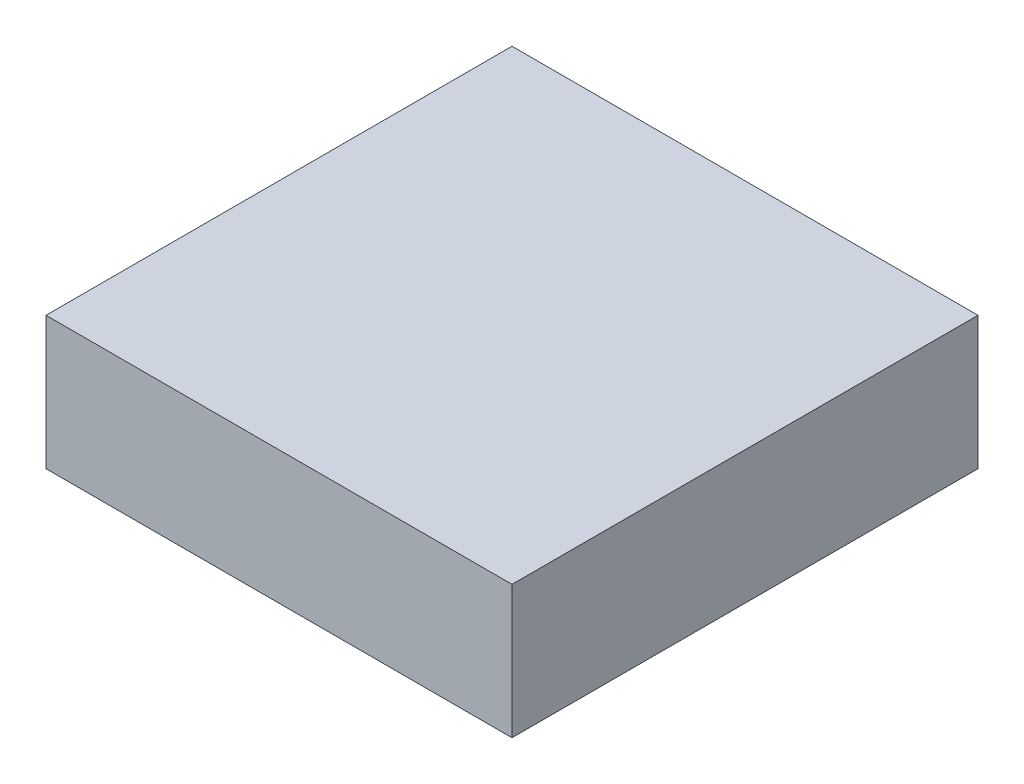
ISO-10303-21;
HEADER;
FILE_DESCRIPTION(('STEP AP214'),'2;1');
FILE_NAME('part.step','',(''),(''),'','','');
FILE_SCHEMA(('AUTOMOTIVE_DESIGN { 1 0 10303 214 1 1 1 1 }'));
ENDSEC;
DATA;
#1=APPLICATION_CONTEXT('core data for automotive mechanical design processes');
#2=APPLICATION_PROTOCOL_DEFINITION('international standard','automotive_design',2000,#1);
#3=PRODUCT_CONTEXT('',#1,'mechanical');
#4=PRODUCT('Part','Part','',(#3));
#5=PRODUCT_RELATED_PRODUCT_CATEGORY('part','',(#4));
#6=PRODUCT_DEFINITION_FORMATION('','',#4);
#7=PRODUCT_DEFINITION_CONTEXT('part definition',#1,'design');
#8=PRODUCT_DEFINITION('design','',#6,#7);
#9=PRODUCT_DEFINITION_SHAPE('','',#8);
#10=(LENGTH_UNIT() NAMED_UNIT(*) SI_UNIT(.MILLI.,.METRE.));
#11=(NAMED_UNIT(*) PLANE_ANGLE_UNIT() SI_UNIT($,.RADIAN.));
#12=(NAMED_UNIT(*) SI_UNIT($,.STERADIAN.) SOLID_ANGLE_UNIT());
#13=UNCERTAINTY_MEASURE_WITH_UNIT(LENGTH_MEASURE(1.E-05),#10,'distance_accuracy_value','');
#14=(GEOMETRIC_REPRESENTATION_CONTEXT(3) GLOBAL_UNCERTAINTY_ASSIGNED_CONTEXT((#13)) GLOBAL_UNIT_ASSIGNED_CONTEXT((#10,
#11,#12)) REPRESENTATION_CONTEXT('',''));
#15=CARTESIAN_POINT('',(0.,0.,0.));
#16=DIRECTION('',(0.,0.,1.));
#17=DIRECTION('',(1.,0.,0.));
#18=AXIS2_PLACEMENT_3D('',#15,#16,#17);
#19=CARTESIAN_POINT('',(-49.1,-28.,-49.1));
#20=DIRECTION('',(-1.,0.,0.));
#21=DIRECTION('',(0.,0.,1.));
#22=AXIS2_PLACEMENT_3D('',#19,#20,#21);
#23=PLANE('',#22);
#24=DIRECTION('',(0.,0.,1.));
#25=VECTOR('',#24,1.);
#26=CARTESIAN_POINT('',(-49.1,0.,-49.1));
#27=LINE('',#26,#25);
#28=CARTESIAN_POINT('',(-49.1,0.,-49.1));
#29=VERTEX_POINT('',#28);
#30=CARTESIAN_POINT('',(-49.1,0.,49.1));
#31=VERTEX_POINT('',#30);
#32=EDGE_CURVE('E282',#29,#31,#27,.T.);
#33=ORIENTED_EDGE('',*,*,#32,.F.);
#34=DIRECTION('',(0.,1.,0.));
#35=VECTOR('',#34,1.);
#36=CARTESIAN_POINT('',(-49.1,-28.,-49.1));
#37=LINE('',#36,#35);
#38=CARTESIAN_POINT('',(-49.1,-28.,-49.1));
#39=VERTEX_POINT('',#38);
#40=EDGE_CURVE('E11',#39,#29,#37,.T.);
#41=ORIENTED_EDGE('',*,*,#40,.F.);
#42=DIRECTION('',(0.,0.,1.));
#43=VECTOR('',#42,1.);
#44=CARTESIAN_POINT('',(-49.1,-28.,-49.1));
#45=LINE('',#44,#43);
#46=CARTESIAN_POINT('',(-49.1,-28.,49.1));
#47=VERTEX_POINT('',#46);
#48=EDGE_CURVE('E292',#39,#47,#45,.T.);
#49=ORIENTED_EDGE('',*,*,#48,.T.);
#50=DIRECTION('',(0.,1.,0.));
#51=VECTOR('',#50,1.);
#52=CARTESIAN_POINT('',(-49.1,-28.,49.1));
#53=LINE('',#52,#51);
#54=EDGE_CURVE('E44',#47,#31,#53,.T.);
#55=ORIENTED_EDGE('',*,*,#54,.T.);
#56=EDGE_LOOP('',(#33,#41,#49,#55));
#57=FACE_BOUND('',#56,.T.);
#58=ADVANCED_FACE('F41',(#57),#23,.T.);
#59=CARTESIAN_POINT('',(-49.1,-28.,-49.1));
#60=DIRECTION('',(0.,0.,-1.));
#61=DIRECTION('',(-1.,0.,0.));
#62=AXIS2_PLACEMENT_3D('',#59,#60,#61);
#63=PLANE('',#62);
#64=DIRECTION('',(-1.,0.,0.));
#65=VECTOR('',#64,1.);
#66=CARTESIAN_POINT('',(-49.1,0.,-49.1));
#67=LINE('',#66,#65);
#68=CARTESIAN_POINT('',(49.1,0.,-49.1));
#69=VERTEX_POINT('',#68);
#70=EDGE_CURVE('E297',#69,#29,#67,.T.);
#71=ORIENTED_EDGE('',*,*,#70,.F.);
#72=DIRECTION('',(0.,1.,0.));
#73=VECTOR('',#72,1.);
#74=CARTESIAN_POINT('',(49.1,-28.,-49.1));
#75=LINE('',#74,#73);
#76=CARTESIAN_POINT('',(49.1,-28.,-49.1));
#77=VERTEX_POINT('',#76);
#78=EDGE_CURVE('E50',#77,#69,#75,.T.);
#79=ORIENTED_EDGE('',*,*,#78,.F.);
#80=DIRECTION('',(-1.,0.,0.));
#81=VECTOR('',#80,1.);
#82=CARTESIAN_POINT('',(-49.1,-28.,-49.1));
#83=LINE('',#82,#81);
#84=EDGE_CURVE('E305',#77,#39,#83,.T.);
#85=ORIENTED_EDGE('',*,*,#84,.T.);
#86=ORIENTED_EDGE('',*,*,#40,.T.);
#87=EDGE_LOOP('',(#71,#79,#85,#86));
#88=FACE_BOUND('',#87,.T.);
#89=ADVANCED_FACE('F339',(#88),#63,.T.);
#90=CARTESIAN_POINT('',(49.1,-28.,-49.1));
#91=DIRECTION('',(1.,0.,0.));
#92=DIRECTION('',(0.,0.,-1.));
#93=AXIS2_PLACEMENT_3D('',#90,#91,#92);
#94=PLANE('',#93);
#95=DIRECTION('',(0.,0.,-1.));
#96=VECTOR('',#95,1.);
#97=CARTESIAN_POINT('',(49.1,0.,-49.1));
#98=LINE('',#97,#96);
#99=CARTESIAN_POINT('',(49.1,0.,49.1));
#100=VERTEX_POINT('',#99);
#101=EDGE_CURVE('E316',#100,#69,#98,.T.);
#102=ORIENTED_EDGE('',*,*,#101,.F.);
#103=DIRECTION('',(0.,1.,0.));
#104=VECTOR('',#103,1.);
#105=CARTESIAN_POINT('',(49.1,-28.,49.1));
#106=LINE('',#105,#104);
#107=CARTESIAN_POINT('',(49.1,-28.,49.1));
#108=VERTEX_POINT('',#107);
#109=EDGE_CURVE('E324',#108,#100,#106,.T.);
#110=ORIENTED_EDGE('',*,*,#109,.F.);
#111=DIRECTION('',(0.,0.,-1.));
#112=VECTOR('',#111,1.);
#113=CARTESIAN_POINT('',(49.1,-28.,-49.1));
#114=LINE('',#113,#112);
#115=EDGE_CURVE('E301',#108,#77,#114,.T.);
#116=ORIENTED_EDGE('',*,*,#115,.T.);
#117=ORIENTED_EDGE('',*,*,#78,.T.);
#118=EDGE_LOOP('',(#102,#110,#116,#117));
#119=FACE_BOUND('',#118,.T.);
#120=ADVANCED_FACE('F345',(#119),#94,.T.);
#121=CARTESIAN_POINT('',(-49.1,-28.,49.1));
#122=DIRECTION('',(0.,0.,1.));
#123=DIRECTION('',(1.,0.,0.));
#124=AXIS2_PLACEMENT_3D('',#121,#122,#123);
#125=PLANE('',#124);
#126=DIRECTION('',(1.,0.,0.));
#127=VECTOR('',#126,1.);
#128=CARTESIAN_POINT('',(-49.1,0.,49.1));
#129=LINE('',#128,#127);
#130=EDGE_CURVE('E312',#31,#100,#129,.T.);
#131=ORIENTED_EDGE('',*,*,#130,.F.);
#132=ORIENTED_EDGE('',*,*,#54,.F.);
#133=DIRECTION('',(1.,0.,0.));
#134=VECTOR('',#133,1.);
#135=CARTESIAN_POINT('',(-49.1,-28.,49.1));
#136=LINE('',#135,#134);
#137=EDGE_CURVE('E296',#47,#108,#136,.T.);
#138=ORIENTED_EDGE('',*,*,#137,.T.);
#139=ORIENTED_EDGE('',*,*,#109,.T.);
#140=EDGE_LOOP('',(#131,#132,#138,#139));
#141=FACE_BOUND('',#140,.T.);
#142=ADVANCED_FACE('F334',(#141),#125,.T.);
#143=CARTESIAN_POINT('',(0.,-28.,0.));
#144=DIRECTION('',(0.,1.,0.));
#145=DIRECTION('',(0.,0.,1.));
#146=AXIS2_PLACEMENT_3D('',#143,#144,#145);
#147=PLANE('',#146);
#148=DIRECTION('',(1.,0.,0.));
#149=VECTOR('',#148,1.);
#150=CARTESIAN_POINT('',(-45.1,-28.,-45.1));
#151=LINE('',#150,#149);
#152=CARTESIAN_POINT('',(-45.1,-28.,-45.1));
#153=VERTEX_POINT('',#152);
#154=CARTESIAN_POINT('',(45.1,-28.,-45.1));
#155=VERTEX_POINT('',#154);
#156=EDGE_CURVE('E268',#153,#155,#151,.T.);
#157=ORIENTED_EDGE('',*,*,#156,.F.);
#158=DIRECTION('',(0.,0.,-1.));
#159=VECTOR('',#158,1.);
#160=CARTESIAN_POINT('',(-45.1,-28.,45.1));
#161=LINE('',#160,#159);
#162=CARTESIAN_POINT('',(-45.1,-28.,45.1));
#163=VERTEX_POINT('',#162);
#164=EDGE_CURVE('E247',#163,#153,#161,.T.);
#165=ORIENTED_EDGE('',*,*,#164,.F.);
#166=DIRECTION('',(-1.,0.,0.));
#167=VECTOR('',#166,1.);
#168=CARTESIAN_POINT('',(-45.1,-28.,45.1));
#169=LINE('',#168,#167);
#170=CARTESIAN_POINT('',(45.1,-28.,45.1));
#171=VERTEX_POINT('',#170);
#172=EDGE_CURVE('E253',#171,#163,#169,.T.);
#173=ORIENTED_EDGE('',*,*,#172,.F.);
#174=DIRECTION('',(0.,0.,1.));
#175=VECTOR('',#174,1.);
#176=CARTESIAN_POINT('',(45.1,-28.,45.1));
#177=LINE('',#176,#175);
#178=EDGE_CURVE('E272',#155,#171,#177,.T.);
#179=ORIENTED_EDGE('',*,*,#178,.F.);
#180=EDGE_LOOP('',(#157,#165,#173,#179));
#181=FACE_BOUND('',#180,.T.);
#182=ORIENTED_EDGE('',*,*,#48,.F.);
#183=ORIENTED_EDGE('',*,*,#84,.F.);
#184=ORIENTED_EDGE('',*,*,#115,.F.);
#185=ORIENTED_EDGE('',*,*,#137,.F.);
#186=EDGE_LOOP('',(#182,#183,#184,#185));
#187=FACE_BOUND('',#186,.T.);
#188=ADVANCED_FACE('F342',(#181,#187),#147,.F.);
#189=CARTESIAN_POINT('',(0.,0.,0.));
#190=DIRECTION('',(0.,1.,0.));
#191=DIRECTION('',(0.,0.,1.));
#192=AXIS2_PLACEMENT_3D('',#189,#190,#191);
#193=PLANE('',#192);
#194=ORIENTED_EDGE('',*,*,#32,.T.);
#195=ORIENTED_EDGE('',*,*,#130,.T.);
#196=ORIENTED_EDGE('',*,*,#101,.T.);
#197=ORIENTED_EDGE('',*,*,#70,.T.);
#198=EDGE_LOOP('',(#194,#195,#196,#197));
#199=FACE_BOUND('',#198,.T.);
#200=ADVANCED_FACE('F336',(#199),#193,.T.);
#201=CARTESIAN_POINT('',(-45.1,-4.,45.1));
#202=DIRECTION('',(-1.,0.,0.));
#203=DIRECTION('',(0.,0.,1.));
#204=AXIS2_PLACEMENT_3D('',#201,#202,#203);
#205=PLANE('',#204);
#206=ORIENTED_EDGE('',*,*,#164,.T.);
#207=DIRECTION('',(0.,-1.,0.));
#208=VECTOR('',#207,1.);
#209=CARTESIAN_POINT('',(-45.1,-4.,-45.1));
#210=LINE('',#209,#208);
#211=CARTESIAN_POINT('',(-45.1,-4.,-45.1));
#212=VERTEX_POINT('',#211);
#213=EDGE_CURVE('E265',#212,#153,#210,.T.);
#214=ORIENTED_EDGE('',*,*,#213,.F.);
#215=DIRECTION('',(0.,0.,-1.));
#216=VECTOR('',#215,1.);
#217=CARTESIAN_POINT('',(-45.1,-4.,45.1));
#218=LINE('',#217,#216);
#219=CARTESIAN_POINT('',(-45.1,-4.,45.1));
#220=VERTEX_POINT('',#219);
#221=EDGE_CURVE('E248',#220,#212,#218,.T.);
#222=ORIENTED_EDGE('',*,*,#221,.F.);
#223=DIRECTION('',(0.,-1.,0.));
#224=VECTOR('',#223,1.);
#225=CARTESIAN_POINT('',(-45.1,-4.,45.1));
#226=LINE('',#225,#224);
#227=EDGE_CURVE('E279',#220,#163,#226,.T.);
#228=ORIENTED_EDGE('',*,*,#227,.T.);
#229=EDGE_LOOP('',(#206,#214,#222,#228));
#230=FACE_BOUND('',#229,.T.);
#231=ADVANCED_FACE('F381',(#230),#205,.F.);
#232=CARTESIAN_POINT('',(-45.1,-4.,45.1));
#233=DIRECTION('',(0.,0.,1.));
#234=DIRECTION('',(1.,0.,0.));
#235=AXIS2_PLACEMENT_3D('',#232,#233,#234);
#236=PLANE('',#235);
#237=ORIENTED_EDGE('',*,*,#172,.T.);
#238=ORIENTED_EDGE('',*,*,#227,.F.);
#239=DIRECTION('',(-1.,0.,0.));
#240=VECTOR('',#239,1.);
#241=CARTESIAN_POINT('',(-45.1,-4.,45.1));
#242=LINE('',#241,#240);
#243=CARTESIAN_POINT('',(45.1,-4.,45.1));
#244=VERTEX_POINT('',#243);
#245=EDGE_CURVE('E261',#244,#220,#242,.T.);
#246=ORIENTED_EDGE('',*,*,#245,.F.);
#247=DIRECTION('',(0.,-1.,0.));
#248=VECTOR('',#247,1.);
#249=CARTESIAN_POINT('',(45.1,-4.,45.1));
#250=LINE('',#249,#248);
#251=EDGE_CURVE('E283',#244,#171,#250,.T.);
#252=ORIENTED_EDGE('',*,*,#251,.T.);
#253=EDGE_LOOP('',(#237,#238,#246,#252));
#254=FACE_BOUND('',#253,.T.);
#255=ADVANCED_FACE('F397',(#254),#236,.F.);
#256=CARTESIAN_POINT('',(45.1,-4.,45.1));
#257=DIRECTION('',(1.,0.,0.));
#258=DIRECTION('',(0.,0.,-1.));
#259=AXIS2_PLACEMENT_3D('',#256,#257,#258);
#260=PLANE('',#259);
#261=ORIENTED_EDGE('',*,*,#178,.T.);
#262=ORIENTED_EDGE('',*,*,#251,.F.);
#263=DIRECTION('',(0.,0.,1.));
#264=VECTOR('',#263,1.);
#265=CARTESIAN_POINT('',(45.1,-4.,45.1));
#266=LINE('',#265,#264);
#267=CARTESIAN_POINT('',(45.1,-4.,-45.1));
#268=VERTEX_POINT('',#267);
#269=EDGE_CURVE('E257',#268,#244,#266,.T.);
#270=ORIENTED_EDGE('',*,*,#269,.F.);
#271=DIRECTION('',(0.,-1.,0.));
#272=VECTOR('',#271,1.);
#273=CARTESIAN_POINT('',(45.1,-4.,-45.1));
#274=LINE('',#273,#272);
#275=EDGE_CURVE('E286',#268,#155,#274,.T.);
#276=ORIENTED_EDGE('',*,*,#275,.T.);
#277=EDGE_LOOP('',(#261,#262,#270,#276));
#278=FACE_BOUND('',#277,.T.);
#279=ADVANCED_FACE('F407',(#278),#260,.F.);
#280=CARTESIAN_POINT('',(-45.1,-4.,-45.1));
#281=DIRECTION('',(0.,0.,-1.));
#282=DIRECTION('',(-1.,0.,0.));
#283=AXIS2_PLACEMENT_3D('',#280,#281,#282);
#284=PLANE('',#283);
#285=ORIENTED_EDGE('',*,*,#156,.T.);
#286=ORIENTED_EDGE('',*,*,#275,.F.);
#287=DIRECTION('',(1.,0.,0.));
#288=VECTOR('',#287,1.);
#289=CARTESIAN_POINT('',(-45.1,-4.,-45.1));
#290=LINE('',#289,#288);
#291=EDGE_CURVE('E252',#212,#268,#290,.T.);
#292=ORIENTED_EDGE('',*,*,#291,.F.);
#293=ORIENTED_EDGE('',*,*,#213,.T.);
#294=EDGE_LOOP('',(#285,#286,#292,#293));
#295=FACE_BOUND('',#294,.T.);
#296=ADVANCED_FACE('F417',(#295),#284,.F.);
#297=CARTESIAN_POINT('',(0.,-4.,0.));
#298=DIRECTION('',(0.,-1.,0.));
#299=DIRECTION('',(0.,0.,-1.));
#300=AXIS2_PLACEMENT_3D('',#297,#298,#299);
#301=PLANE('',#300);
#302=DIRECTION('',(0.,0.,-1.));
#303=VECTOR('',#302,1.);
#304=CARTESIAN_POINT('',(16.79,-4.,0.));
#305=LINE('',#304,#303);
#306=CARTESIAN_POINT('',(16.79,-4.,11.1));
#307=VERTEX_POINT('',#306);
#308=CARTESIAN_POINT('',(16.79,-4.,-23.9));
#309=VERTEX_POINT('',#308);
#310=EDGE_CURVE('E164',#307,#309,#305,.T.);
#311=ORIENTED_EDGE('',*,*,#310,.T.);
#312=DIRECTION('',(1.,0.,0.));
#313=VECTOR('',#312,1.);
#314=CARTESIAN_POINT('',(0.,-4.,-23.9));
#315=LINE('',#314,#313);
#316=CARTESIAN_POINT('',(14.19,-4.,-23.9));
#317=VERTEX_POINT('',#316);
#318=EDGE_CURVE('E180',#317,#309,#315,.T.);
#319=ORIENTED_EDGE('',*,*,#318,.F.);
#320=DIRECTION('',(0.,0.,-1.));
#321=VECTOR('',#320,1.);
#322=CARTESIAN_POINT('',(14.19,-4.,0.));
#323=LINE('',#322,#321);
#324=CARTESIAN_POINT('',(14.19,-4.,11.1));
#325=VERTEX_POINT('',#324);
#326=EDGE_CURVE('E198',#325,#317,#323,.T.);
#327=ORIENTED_EDGE('',*,*,#326,.F.);
#328=DIRECTION('',(1.,0.,0.));
#329=VECTOR('',#328,1.);
#330=CARTESIAN_POINT('',(0.,-4.,11.1));
#331=LINE('',#330,#329);
#332=EDGE_CURVE('E195',#325,#307,#331,.T.);
#333=ORIENTED_EDGE('',*,*,#332,.T.);
#334=EDGE_LOOP('',(#311,#319,#327,#333));
#335=FACE_BOUND('',#334,.T.);
#336=DIRECTION('',(0.,0.,1.));
#337=VECTOR('',#336,1.);
#338=CARTESIAN_POINT('',(-15.6,-4.,0.));
#339=LINE('',#338,#337);
#340=CARTESIAN_POINT('',(-15.6,-4.,-23.9));
#341=VERTEX_POINT('',#340);
#342=CARTESIAN_POINT('',(-15.6,-4.,11.1));
#343=VERTEX_POINT('',#342);
#344=EDGE_CURVE('E170',#341,#343,#339,.T.);
#345=ORIENTED_EDGE('',*,*,#344,.T.);
#346=DIRECTION('',(-1.,0.,0.));
#347=VECTOR('',#346,1.);
#348=CARTESIAN_POINT('',(0.,-4.,11.1));
#349=LINE('',#348,#347);
#350=CARTESIAN_POINT('',(-13.,-4.,11.1));
#351=VERTEX_POINT('',#350);
#352=EDGE_CURVE('E214',#351,#343,#349,.T.);
#353=ORIENTED_EDGE('',*,*,#352,.F.);
#354=DIRECTION('',(0.,0.,1.));
#355=VECTOR('',#354,1.);
#356=CARTESIAN_POINT('',(-13.,-4.,0.));
#357=LINE('',#356,#355);
#358=CARTESIAN_POINT('',(-13.,-4.,-23.9));
#359=VERTEX_POINT('',#358);
#360=EDGE_CURVE('E232',#359,#351,#357,.T.);
#361=ORIENTED_EDGE('',*,*,#360,.F.);
#362=DIRECTION('',(-1.,0.,0.));
#363=VECTOR('',#362,1.);
#364=CARTESIAN_POINT('',(0.,-4.,-23.9));
#365=LINE('',#364,#363);
#366=EDGE_CURVE('E228',#359,#341,#365,.T.);
#367=ORIENTED_EDGE('',*,*,#366,.T.);
#368=EDGE_LOOP('',(#345,#353,#361,#367));
#369=FACE_BOUND('',#368,.T.);
#370=ORIENTED_EDGE('',*,*,#221,.T.);
#371=ORIENTED_EDGE('',*,*,#291,.T.);
#372=ORIENTED_EDGE('',*,*,#269,.T.);
#373=ORIENTED_EDGE('',*,*,#245,.T.);
#374=EDGE_LOOP('',(#370,#371,#372,#373));
#375=FACE_BOUND('',#374,.T.);
#376=ADVANCED_FACE('F427',(#335,#369,#375),#301,.T.);
#377=CARTESIAN_POINT('',(-15.6,-26.,0.));
#378=DIRECTION('',(-1.,0.,0.));
#379=DIRECTION('',(0.,0.,1.));
#380=AXIS2_PLACEMENT_3D('',#377,#378,#379);
#381=PLANE('',#380);
#382=ORIENTED_EDGE('',*,*,#344,.F.);
#383=DIRECTION('',(0.,1.,0.));
#384=VECTOR('',#383,1.);
#385=CARTESIAN_POINT('',(-15.6,-26.,-23.9));
#386=LINE('',#385,#384);
#387=CARTESIAN_POINT('',(-15.6,-26.,-23.9));
#388=VERTEX_POINT('',#387);
#389=EDGE_CURVE('E244',#388,#341,#386,.T.);
#390=ORIENTED_EDGE('',*,*,#389,.F.);
#391=DIRECTION('',(0.,0.,1.));
#392=VECTOR('',#391,1.);
#393=CARTESIAN_POINT('',(-15.6,-26.,0.));
#394=LINE('',#393,#392);
#395=CARTESIAN_POINT('',(-15.6,-26.,11.1));
#396=VERTEX_POINT('',#395);
#397=EDGE_CURVE('E209',#388,#396,#394,.T.);
#398=ORIENTED_EDGE('',*,*,#397,.T.);
#399=DIRECTION('',(0.,1.,0.));
#400=VECTOR('',#399,1.);
#401=CARTESIAN_POINT('',(-15.6,-26.,11.1));
#402=LINE('',#401,#400);
#403=EDGE_CURVE('E224',#396,#343,#402,.T.);
#404=ORIENTED_EDGE('',*,*,#403,.T.);
#405=EDGE_LOOP('',(#382,#390,#398,#404));
#406=FACE_BOUND('',#405,.T.);
#407=ADVANCED_FACE('F435',(#406),#381,.T.);
#408=CARTESIAN_POINT('',(0.,-26.,-23.9));
#409=DIRECTION('',(0.,0.,-1.));
#410=DIRECTION('',(-1.,0.,0.));
#411=AXIS2_PLACEMENT_3D('',#408,#409,#410);
#412=PLANE('',#411);
#413=ORIENTED_EDGE('',*,*,#366,.F.);
#414=DIRECTION('',(0.,1.,0.));
#415=VECTOR('',#414,1.);
#416=CARTESIAN_POINT('',(-13.,-26.,-23.9));
#417=LINE('',#416,#415);
#418=CARTESIAN_POINT('',(-13.,-26.,-23.9));
#419=VERTEX_POINT('',#418);
#420=EDGE_CURVE('E241',#419,#359,#417,.T.);
#421=ORIENTED_EDGE('',*,*,#420,.F.);
#422=DIRECTION('',(-1.,0.,0.));
#423=VECTOR('',#422,1.);
#424=CARTESIAN_POINT('',(0.,-26.,-23.9));
#425=LINE('',#424,#423);
#426=EDGE_CURVE('E213',#419,#388,#425,.T.);
#427=ORIENTED_EDGE('',*,*,#426,.T.);
#428=ORIENTED_EDGE('',*,*,#389,.T.);
#429=EDGE_LOOP('',(#413,#421,#427,#428));
#430=FACE_BOUND('',#429,.T.);
#431=ADVANCED_FACE('F440',(#430),#412,.T.);
#432=CARTESIAN_POINT('',(-13.,-26.,0.));
#433=DIRECTION('',(-1.,0.,0.));
#434=DIRECTION('',(0.,0.,1.));
#435=AXIS2_PLACEMENT_3D('',#432,#433,#434);
#436=PLANE('',#435);
#437=ORIENTED_EDGE('',*,*,#360,.T.);
#438=DIRECTION('',(0.,1.,0.));
#439=VECTOR('',#438,1.);
#440=CARTESIAN_POINT('',(-13.,-26.,11.1));
#441=LINE('',#440,#439);
#442=CARTESIAN_POINT('',(-13.,-26.,11.1));
#443=VERTEX_POINT('',#442);
#444=EDGE_CURVE('E66',#443,#351,#441,.T.);
#445=ORIENTED_EDGE('',*,*,#444,.F.);
#446=DIRECTION('',(0.,0.,1.));
#447=VECTOR('',#446,1.);
#448=CARTESIAN_POINT('',(-13.,-26.,0.));
#449=LINE('',#448,#447);
#450=EDGE_CURVE('E218',#419,#443,#449,.T.);
#451=ORIENTED_EDGE('',*,*,#450,.F.);
#452=ORIENTED_EDGE('',*,*,#420,.T.);
#453=EDGE_LOOP('',(#437,#445,#451,#452));
#454=FACE_BOUND('',#453,.T.);
#455=ADVANCED_FACE('F450',(#454),#436,.F.);
#456=CARTESIAN_POINT('',(0.,-26.,11.1));
#457=DIRECTION('',(0.,0.,-1.));
#458=DIRECTION('',(-1.,0.,0.));
#459=AXIS2_PLACEMENT_3D('',#456,#457,#458);
#460=PLANE('',#459);
#461=ORIENTED_EDGE('',*,*,#352,.T.);
#462=ORIENTED_EDGE('',*,*,#403,.F.);
#463=DIRECTION('',(-1.,0.,0.));
#464=VECTOR('',#463,1.);
#465=CARTESIAN_POINT('',(0.,-26.,11.1));
#466=LINE('',#465,#464);
#467=EDGE_CURVE('E221',#443,#396,#466,.T.);
#468=ORIENTED_EDGE('',*,*,#467,.F.);
#469=ORIENTED_EDGE('',*,*,#444,.T.);
#470=EDGE_LOOP('',(#461,#462,#468,#469));
#471=FACE_BOUND('',#470,.T.);
#472=ADVANCED_FACE('F461',(#471),#460,.F.);
#473=CARTESIAN_POINT('',(0.,-26.,0.));
#474=DIRECTION('',(0.,-1.,0.));
#475=DIRECTION('',(0.,0.,-1.));
#476=AXIS2_PLACEMENT_3D('',#473,#474,#475);
#477=PLANE('',#476);
#478=ORIENTED_EDGE('',*,*,#397,.F.);
#479=ORIENTED_EDGE('',*,*,#426,.F.);
#480=ORIENTED_EDGE('',*,*,#450,.T.);
#481=ORIENTED_EDGE('',*,*,#467,.T.);
#482=EDGE_LOOP('',(#478,#479,#480,#481));
#483=FACE_BOUND('',#482,.T.);
#484=ADVANCED_FACE('F471',(#483),#477,.T.);
#485=CARTESIAN_POINT('',(16.79,-26.,0.));
#486=DIRECTION('',(1.,0.,0.));
#487=DIRECTION('',(0.,0.,-1.));
#488=AXIS2_PLACEMENT_3D('',#485,#486,#487);
#489=PLANE('',#488);
#490=ORIENTED_EDGE('',*,*,#310,.F.);
#491=DIRECTION('',(0.,1.,0.));
#492=VECTOR('',#491,1.);
#493=CARTESIAN_POINT('',(16.79,-26.,11.1));
#494=LINE('',#493,#492);
#495=CARTESIAN_POINT('',(16.79,-26.,11.1));
#496=VERTEX_POINT('',#495);
#497=EDGE_CURVE('E159',#496,#307,#494,.T.);
#498=ORIENTED_EDGE('',*,*,#497,.F.);
#499=DIRECTION('',(0.,0.,-1.));
#500=VECTOR('',#499,1.);
#501=CARTESIAN_POINT('',(16.79,-26.,0.));
#502=LINE('',#501,#500);
#503=CARTESIAN_POINT('',(16.79,-26.,-23.9));
#504=VERTEX_POINT('',#503);
#505=EDGE_CURVE('E162',#496,#504,#502,.T.);
#506=ORIENTED_EDGE('',*,*,#505,.T.);
#507=DIRECTION('',(0.,1.,0.));
#508=VECTOR('',#507,1.);
#509=CARTESIAN_POINT('',(16.79,-26.,-23.9));
#510=LINE('',#509,#508);
#511=EDGE_CURVE('E192',#504,#309,#510,.T.);
#512=ORIENTED_EDGE('',*,*,#511,.T.);
#513=EDGE_LOOP('',(#490,#498,#506,#512));
#514=FACE_BOUND('',#513,.T.);
#515=ADVANCED_FACE('F161',(#514),#489,.T.);
#516=CARTESIAN_POINT('',(0.,-26.,11.1));
#517=DIRECTION('',(0.,0.,1.));
#518=DIRECTION('',(1.,0.,0.));
#519=AXIS2_PLACEMENT_3D('',#516,#517,#518);
#520=PLANE('',#519);
#521=ORIENTED_EDGE('',*,*,#332,.F.);
#522=DIRECTION('',(0.,1.,0.));
#523=VECTOR('',#522,1.);
#524=CARTESIAN_POINT('',(14.19,-26.,11.1));
#525=LINE('',#524,#523);
#526=CARTESIAN_POINT('',(14.19,-26.,11.1));
#527=VERTEX_POINT('',#526);
#528=EDGE_CURVE('E171',#527,#325,#525,.T.);
#529=ORIENTED_EDGE('',*,*,#528,.F.);
#530=DIRECTION('',(1.,0.,0.));
#531=VECTOR('',#530,1.);
#532=CARTESIAN_POINT('',(0.,-26.,11.1));
#533=LINE('',#532,#531);
#534=EDGE_CURVE('E176',#527,#496,#533,.T.);
#535=ORIENTED_EDGE('',*,*,#534,.T.);
#536=ORIENTED_EDGE('',*,*,#497,.T.);
#537=EDGE_LOOP('',(#521,#529,#535,#536));
#538=FACE_BOUND('',#537,.T.);
#539=ADVANCED_FACE('F182',(#538),#520,.T.);
#540=CARTESIAN_POINT('',(14.19,-26.,0.));
#541=DIRECTION('',(1.,0.,0.));
#542=DIRECTION('',(0.,0.,-1.));
#543=AXIS2_PLACEMENT_3D('',#540,#541,#542);
#544=PLANE('',#543);
#545=ORIENTED_EDGE('',*,*,#326,.T.);
#546=DIRECTION('',(0.,1.,0.));
#547=VECTOR('',#546,1.);
#548=CARTESIAN_POINT('',(14.19,-26.,-23.9));
#549=LINE('',#548,#547);
#550=CARTESIAN_POINT('',(14.19,-26.,-23.9));
#551=VERTEX_POINT('',#550);
#552=EDGE_CURVE('E58',#551,#317,#549,.T.);
#553=ORIENTED_EDGE('',*,*,#552,.F.);
#554=DIRECTION('',(0.,0.,-1.));
#555=VECTOR('',#554,1.);
#556=CARTESIAN_POINT('',(14.19,-26.,0.));
#557=LINE('',#556,#555);
#558=EDGE_CURVE('E185',#527,#551,#557,.T.);
#559=ORIENTED_EDGE('',*,*,#558,.F.);
#560=ORIENTED_EDGE('',*,*,#528,.T.);
#561=EDGE_LOOP('',(#545,#553,#559,#560));
#562=FACE_BOUND('',#561,.T.);
#563=ADVANCED_FACE('F504',(#562),#544,.F.);
#564=CARTESIAN_POINT('',(0.,-26.,-23.9));
#565=DIRECTION('',(0.,0.,1.));
#566=DIRECTION('',(1.,0.,0.));
#567=AXIS2_PLACEMENT_3D('',#564,#565,#566);
#568=PLANE('',#567);
#569=ORIENTED_EDGE('',*,*,#318,.T.);
#570=ORIENTED_EDGE('',*,*,#511,.F.);
#571=DIRECTION('',(1.,0.,0.));
#572=VECTOR('',#571,1.);
#573=CARTESIAN_POINT('',(0.,-26.,-23.9));
#574=LINE('',#573,#572);
#575=EDGE_CURVE('E177',#551,#504,#574,.T.);
#576=ORIENTED_EDGE('',*,*,#575,.F.);
#577=ORIENTED_EDGE('',*,*,#552,.T.);
#578=EDGE_LOOP('',(#569,#570,#576,#577));
#579=FACE_BOUND('',#578,.T.);
#580=ADVANCED_FACE('F514',(#579),#568,.F.);
#581=CARTESIAN_POINT('',(0.,-26.,0.));
#582=DIRECTION('',(0.,-1.,0.));
#583=DIRECTION('',(0.,0.,-1.));
#584=AXIS2_PLACEMENT_3D('',#581,#582,#583);
#585=PLANE('',#584);
#586=ORIENTED_EDGE('',*,*,#505,.F.);
#587=ORIENTED_EDGE('',*,*,#534,.F.);
#588=ORIENTED_EDGE('',*,*,#558,.T.);
#589=ORIENTED_EDGE('',*,*,#575,.T.);
#590=EDGE_LOOP('',(#586,#587,#588,#589));
#591=FACE_BOUND('',#590,.T.);
#592=ADVANCED_FACE('F175',(#591),#585,.T.);
#593=CLOSED_SHELL('',(#58,#89,#120,#142,#188,#200,#231,#255,#279,#296,#376,#407,#431,#455,#472,
#484,#515,#539,#563,#580,#592));
#594=MANIFOLD_SOLID_BREP('B2',#593);
#595=ADVANCED_BREP_SHAPE_REPRESENTATION('',(#18,#594),#14);
#596=SHAPE_DEFINITION_REPRESENTATION(#9,#595);
ENDSEC;
END-ISO-10303-21;
